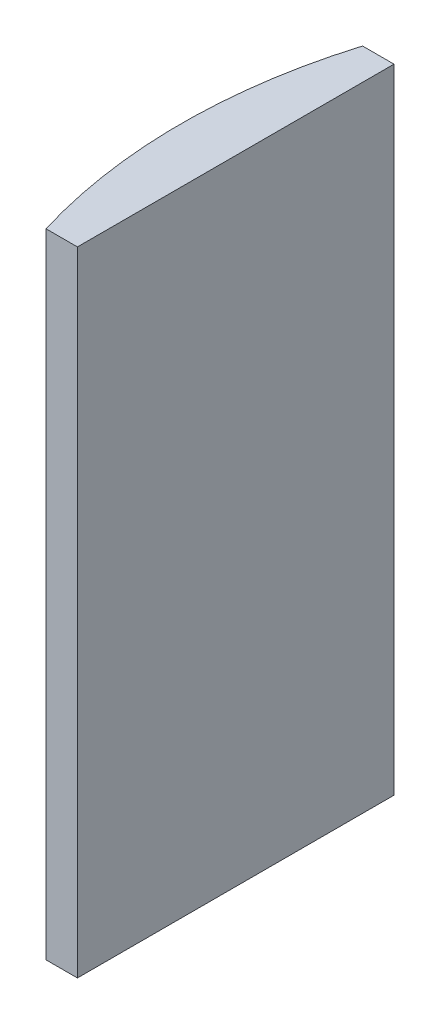
ISO-10303-21;
HEADER;
FILE_DESCRIPTION(('STEP AP214'),'2;1');
FILE_NAME('part.step','',(''),(''),'','','');
FILE_SCHEMA(('AUTOMOTIVE_DESIGN { 1 0 10303 214 1 1 1 1 }'));
ENDSEC;
DATA;
#1=APPLICATION_CONTEXT('core data for automotive mechanical design processes');
#2=APPLICATION_PROTOCOL_DEFINITION('international standard','automotive_design',2000,#1);
#3=PRODUCT_CONTEXT('',#1,'mechanical');
#4=PRODUCT('Part','Part','',(#3));
#5=PRODUCT_RELATED_PRODUCT_CATEGORY('part','',(#4));
#6=PRODUCT_DEFINITION_FORMATION('','',#4);
#7=PRODUCT_DEFINITION_CONTEXT('part definition',#1,'design');
#8=PRODUCT_DEFINITION('design','',#6,#7);
#9=PRODUCT_DEFINITION_SHAPE('','',#8);
#10=(LENGTH_UNIT() NAMED_UNIT(*) SI_UNIT(.MILLI.,.METRE.));
#11=(NAMED_UNIT(*) PLANE_ANGLE_UNIT() SI_UNIT($,.RADIAN.));
#12=(NAMED_UNIT(*) SI_UNIT($,.STERADIAN.) SOLID_ANGLE_UNIT());
#13=UNCERTAINTY_MEASURE_WITH_UNIT(LENGTH_MEASURE(1.E-05),#10,'distance_accuracy_value','');
#14=(GEOMETRIC_REPRESENTATION_CONTEXT(3) GLOBAL_UNCERTAINTY_ASSIGNED_CONTEXT((#13)) GLOBAL_UNIT_ASSIGNED_CONTEXT((#10,
#11,#12)) REPRESENTATION_CONTEXT('',''));
#15=CARTESIAN_POINT('',(0.,0.,0.));
#16=DIRECTION('',(0.,0.,1.));
#17=DIRECTION('',(1.,0.,0.));
#18=AXIS2_PLACEMENT_3D('',#15,#16,#17);
#19=CARTESIAN_POINT('',(4.35520433485127,60.,0.));
#20=DIRECTION('',(0.,-1.,0.));
#21=DIRECTION('',(0.,0.,-1.));
#22=AXIS2_PLACEMENT_3D('',#19,#20,#21);
#23=CYLINDRICAL_SURFACE('',#22,51.7);
#24=CARTESIAN_POINT('',(4.35520433485127,0.,0.));
#25=DIRECTION('',(0.,1.,0.));
#26=DIRECTION('',(0.,0.,1.));
#27=AXIS2_PLACEMENT_3D('',#24,#25,#26);
#28=CIRCLE('',#27,51.7);
#29=CARTESIAN_POINT('',(-45.1209515384581,0.,-15.));
#30=VERTEX_POINT('',#29);
#31=CARTESIAN_POINT('',(-45.1209515384581,0.,15.));
#32=VERTEX_POINT('',#31);
#33=EDGE_CURVE('E100',#30,#32,#28,.T.);
#34=ORIENTED_EDGE('',*,*,#33,.T.);
#35=DIRECTION('',(0.,-1.,0.));
#36=VECTOR('',#35,1.);
#37=CARTESIAN_POINT('',(-45.1209515384581,60.,15.));
#38=LINE('',#37,#36);
#39=CARTESIAN_POINT('',(-45.1209515384581,60.,15.));
#40=VERTEX_POINT('',#39);
#41=EDGE_CURVE('E11',#40,#32,#38,.T.);
#42=ORIENTED_EDGE('',*,*,#41,.F.);
#43=CARTESIAN_POINT('',(4.35520433485127,60.,0.));
#44=DIRECTION('',(0.,1.,0.));
#45=DIRECTION('',(0.,0.,1.));
#46=AXIS2_PLACEMENT_3D('',#43,#44,#45);
#47=CIRCLE('',#46,51.7);
#48=CARTESIAN_POINT('',(-45.1209515384581,60.,-15.));
#49=VERTEX_POINT('',#48);
#50=EDGE_CURVE('E88',#49,#40,#47,.T.);
#51=ORIENTED_EDGE('',*,*,#50,.F.);
#52=DIRECTION('',(0.,-1.,0.));
#53=VECTOR('',#52,1.);
#54=CARTESIAN_POINT('',(-45.1209515384581,60.,-15.));
#55=LINE('',#54,#53);
#56=EDGE_CURVE('E96',#49,#30,#55,.T.);
#57=ORIENTED_EDGE('',*,*,#56,.T.);
#58=EDGE_LOOP('',(#34,#42,#51,#57));
#59=FACE_BOUND('',#58,.T.);
#60=ADVANCED_FACE('F37',(#59),#23,.T.);
#61=CARTESIAN_POINT('',(-45.1209515384581,60.,15.));
#62=DIRECTION('',(0.,0.,-1.));
#63=DIRECTION('',(-1.,0.,0.));
#64=AXIS2_PLACEMENT_3D('',#61,#62,#63);
#65=PLANE('',#64);
#66=DIRECTION('',(1.,0.,0.));
#67=VECTOR('',#66,1.);
#68=CARTESIAN_POINT('',(-45.1209515384581,0.,15.));
#69=LINE('',#68,#67);
#70=CARTESIAN_POINT('',(-42.1447956651487,0.,15.));
#71=VERTEX_POINT('',#70);
#72=EDGE_CURVE('E92',#32,#71,#69,.T.);
#73=ORIENTED_EDGE('',*,*,#72,.T.);
#74=DIRECTION('',(0.,-1.,0.));
#75=VECTOR('',#74,1.);
#76=CARTESIAN_POINT('',(-42.1447956651487,60.,15.));
#77=LINE('',#76,#75);
#78=CARTESIAN_POINT('',(-42.1447956651487,60.,15.));
#79=VERTEX_POINT('',#78);
#80=EDGE_CURVE('E45',#79,#71,#77,.T.);
#81=ORIENTED_EDGE('',*,*,#80,.F.);
#82=DIRECTION('',(1.,0.,0.));
#83=VECTOR('',#82,1.);
#84=CARTESIAN_POINT('',(-45.1209515384581,60.,15.));
#85=LINE('',#84,#83);
#86=EDGE_CURVE('E83',#40,#79,#85,.T.);
#87=ORIENTED_EDGE('',*,*,#86,.F.);
#88=ORIENTED_EDGE('',*,*,#41,.T.);
#89=EDGE_LOOP('',(#73,#81,#87,#88));
#90=FACE_BOUND('',#89,.T.);
#91=ADVANCED_FACE('F91',(#90),#65,.F.);
#92=CARTESIAN_POINT('',(-42.1447956651487,60.,-15.));
#93=DIRECTION('',(-1.,0.,0.));
#94=DIRECTION('',(0.,0.,1.));
#95=AXIS2_PLACEMENT_3D('',#92,#93,#94);
#96=PLANE('',#95);
#97=DIRECTION('',(0.,0.,-1.));
#98=VECTOR('',#97,1.);
#99=CARTESIAN_POINT('',(-42.1447956651487,0.,-15.));
#100=LINE('',#99,#98);
#101=CARTESIAN_POINT('',(-42.1447956651487,0.,-15.));
#102=VERTEX_POINT('',#101);
#103=EDGE_CURVE('E70',#71,#102,#100,.T.);
#104=ORIENTED_EDGE('',*,*,#103,.T.);
#105=DIRECTION('',(0.,-1.,0.));
#106=VECTOR('',#105,1.);
#107=CARTESIAN_POINT('',(-42.1447956651487,60.,-15.));
#108=LINE('',#107,#106);
#109=CARTESIAN_POINT('',(-42.1447956651487,60.,-15.));
#110=VERTEX_POINT('',#109);
#111=EDGE_CURVE('E93',#110,#102,#108,.T.);
#112=ORIENTED_EDGE('',*,*,#111,.F.);
#113=DIRECTION('',(0.,0.,-1.));
#114=VECTOR('',#113,1.);
#115=CARTESIAN_POINT('',(-42.1447956651487,60.,-15.));
#116=LINE('',#115,#114);
#117=EDGE_CURVE('E86',#79,#110,#116,.T.);
#118=ORIENTED_EDGE('',*,*,#117,.F.);
#119=ORIENTED_EDGE('',*,*,#80,.T.);
#120=EDGE_LOOP('',(#104,#112,#118,#119));
#121=FACE_BOUND('',#120,.T.);
#122=ADVANCED_FACE('F94',(#121),#96,.F.);
#123=CARTESIAN_POINT('',(-45.1209515384581,60.,-15.));
#124=DIRECTION('',(0.,0.,1.));
#125=DIRECTION('',(1.,0.,0.));
#126=AXIS2_PLACEMENT_3D('',#123,#124,#125);
#127=PLANE('',#126);
#128=DIRECTION('',(-1.,0.,0.));
#129=VECTOR('',#128,1.);
#130=CARTESIAN_POINT('',(-45.1209515384581,0.,-15.));
#131=LINE('',#130,#129);
#132=EDGE_CURVE('E76',#102,#30,#131,.T.);
#133=ORIENTED_EDGE('',*,*,#132,.T.);
#134=ORIENTED_EDGE('',*,*,#56,.F.);
#135=DIRECTION('',(-1.,0.,0.));
#136=VECTOR('',#135,1.);
#137=CARTESIAN_POINT('',(-45.1209515384581,60.,-15.));
#138=LINE('',#137,#136);
#139=EDGE_CURVE('E53',#110,#49,#138,.T.);
#140=ORIENTED_EDGE('',*,*,#139,.F.);
#141=ORIENTED_EDGE('',*,*,#111,.T.);
#142=EDGE_LOOP('',(#133,#134,#140,#141));
#143=FACE_BOUND('',#142,.T.);
#144=ADVANCED_FACE('F107',(#143),#127,.F.);
#145=CARTESIAN_POINT('',(4.35520433485127,60.,0.));
#146=DIRECTION('',(0.,1.,0.));
#147=DIRECTION('',(0.,0.,1.));
#148=AXIS2_PLACEMENT_3D('',#145,#146,#147);
#149=PLANE('',#148);
#150=ORIENTED_EDGE('',*,*,#50,.T.);
#151=ORIENTED_EDGE('',*,*,#86,.T.);
#152=ORIENTED_EDGE('',*,*,#117,.T.);
#153=ORIENTED_EDGE('',*,*,#139,.T.);
#154=EDGE_LOOP('',(#150,#151,#152,#153));
#155=FACE_BOUND('',#154,.T.);
#156=ADVANCED_FACE('F84',(#155),#149,.T.);
#157=CARTESIAN_POINT('',(4.35520433485127,0.,0.));
#158=DIRECTION('',(0.,1.,0.));
#159=DIRECTION('',(0.,0.,1.));
#160=AXIS2_PLACEMENT_3D('',#157,#158,#159);
#161=PLANE('',#160);
#162=ORIENTED_EDGE('',*,*,#33,.F.);
#163=ORIENTED_EDGE('',*,*,#132,.F.);
#164=ORIENTED_EDGE('',*,*,#103,.F.);
#165=ORIENTED_EDGE('',*,*,#72,.F.);
#166=EDGE_LOOP('',(#162,#163,#164,#165));
#167=FACE_BOUND('',#166,.T.);
#168=ADVANCED_FACE('F110',(#167),#161,.F.);
#169=CLOSED_SHELL('',(#60,#91,#122,#144,#156,#168));
#170=MANIFOLD_SOLID_BREP('B2',#169);
#171=ADVANCED_BREP_SHAPE_REPRESENTATION('',(#18,#170),#14);
#172=SHAPE_DEFINITION_REPRESENTATION(#9,#171);
ENDSEC;
END-ISO-10303-21;
